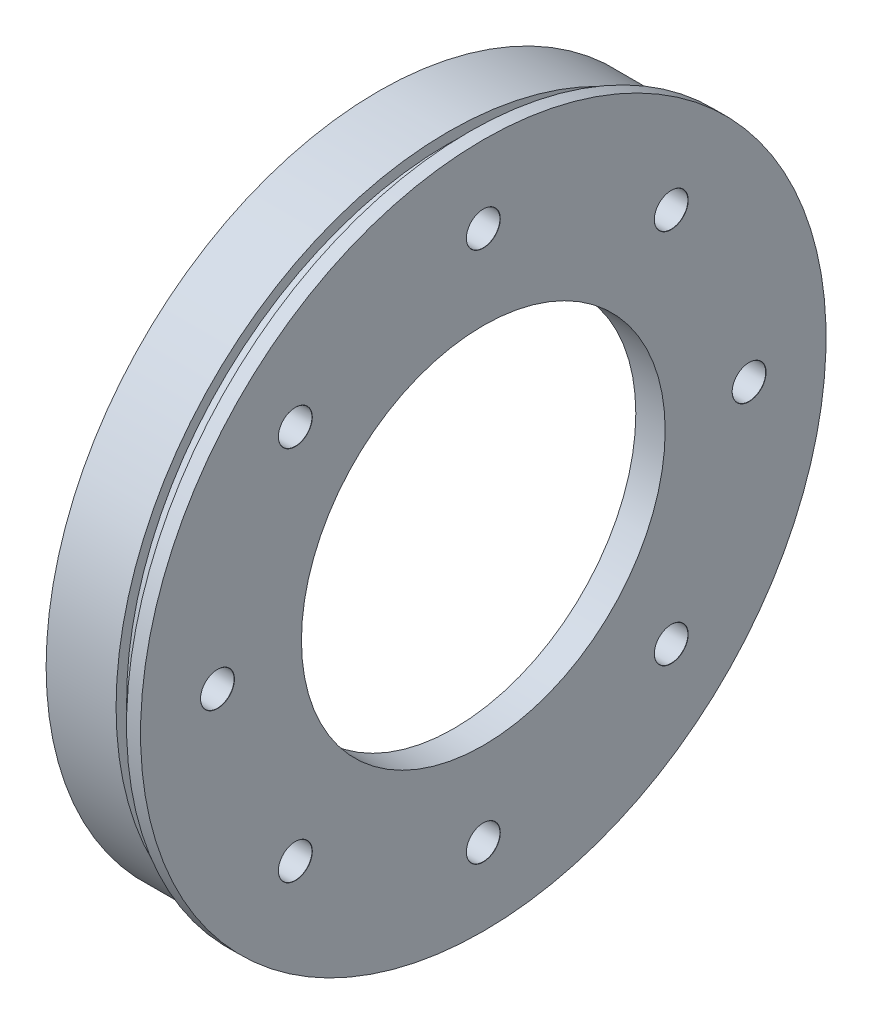
ISO-10303-21;
HEADER;
FILE_DESCRIPTION(('STEP AP214'),'2;1');
FILE_NAME('part.step','',(''),(''),'','','');
FILE_SCHEMA(('AUTOMOTIVE_DESIGN { 1 0 10303 214 1 1 1 1 }'));
ENDSEC;
DATA;
#1=APPLICATION_CONTEXT('core data for automotive mechanical design processes');
#2=APPLICATION_PROTOCOL_DEFINITION('international standard','automotive_design',2000,#1);
#3=PRODUCT_CONTEXT('',#1,'mechanical');
#4=PRODUCT('Part','Part','',(#3));
#5=PRODUCT_RELATED_PRODUCT_CATEGORY('part','',(#4));
#6=PRODUCT_DEFINITION_FORMATION('','',#4);
#7=PRODUCT_DEFINITION_CONTEXT('part definition',#1,'design');
#8=PRODUCT_DEFINITION('design','',#6,#7);
#9=PRODUCT_DEFINITION_SHAPE('','',#8);
#10=(LENGTH_UNIT() NAMED_UNIT(*) SI_UNIT(.MILLI.,.METRE.));
#11=(NAMED_UNIT(*) PLANE_ANGLE_UNIT() SI_UNIT($,.RADIAN.));
#12=(NAMED_UNIT(*) SI_UNIT($,.STERADIAN.) SOLID_ANGLE_UNIT());
#13=UNCERTAINTY_MEASURE_WITH_UNIT(LENGTH_MEASURE(1.E-05),#10,'distance_accuracy_value','');
#14=(GEOMETRIC_REPRESENTATION_CONTEXT(3) GLOBAL_UNCERTAINTY_ASSIGNED_CONTEXT((#13)) GLOBAL_UNIT_ASSIGNED_CONTEXT((#10,
#11,#12)) REPRESENTATION_CONTEXT('',''));
#15=CARTESIAN_POINT('',(0.,0.,0.));
#16=DIRECTION('',(0.,0.,1.));
#17=DIRECTION('',(1.,0.,0.));
#18=AXIS2_PLACEMENT_3D('',#15,#16,#17);
#19=CARTESIAN_POINT('',(0.,0.,0.));
#20=DIRECTION('',(1.,0.,0.));
#21=DIRECTION('',(0.,1.,0.));
#22=AXIS2_PLACEMENT_3D('',#19,#20,#21);
#23=CYLINDRICAL_SURFACE('',#22,26.);
#24=CARTESIAN_POINT('',(0.,0.,0.));
#25=DIRECTION('',(1.,0.,0.));
#26=DIRECTION('',(0.,1.,0.));
#27=AXIS2_PLACEMENT_3D('',#24,#25,#26);
#28=CIRCLE('',#27,26.);
#29=CARTESIAN_POINT('',(0.,26.,0.));
#30=VERTEX_POINT('',#29);
#31=EDGE_CURVE('E163',#30,#30,#28,.T.);
#32=ORIENTED_EDGE('',*,*,#31,.T.);
#33=EDGE_LOOP('',(#32));
#34=FACE_BOUND('',#33,.T.);
#35=CARTESIAN_POINT('',(-4.19999999999999,0.,0.));
#36=DIRECTION('',(-1.,0.,0.));
#37=DIRECTION('',(0.,-1.,0.));
#38=AXIS2_PLACEMENT_3D('',#35,#36,#37);
#39=CIRCLE('',#38,26.);
#40=CARTESIAN_POINT('',(-4.19999999999999,-26.,0.));
#41=VERTEX_POINT('',#40);
#42=EDGE_CURVE('E40',#41,#41,#39,.T.);
#43=ORIENTED_EDGE('',*,*,#42,.T.);
#44=EDGE_LOOP('',(#43));
#45=FACE_BOUND('',#44,.T.);
#46=ADVANCED_FACE('F36',(#34,#45),#23,.F.);
#47=CARTESIAN_POINT('',(-15.,42.8,0.));
#48=DIRECTION('',(-1.,0.,0.));
#49=DIRECTION('',(0.,-1.,0.));
#50=AXIS2_PLACEMENT_3D('',#47,#48,#49);
#51=PLANE('',#50);
#52=CARTESIAN_POINT('',(-15.,0.,0.));
#53=DIRECTION('',(1.,0.,0.));
#54=DIRECTION('',(0.,1.,0.));
#55=AXIS2_PLACEMENT_3D('',#52,#53,#54);
#56=CIRCLE('',#55,42.8);
#57=CARTESIAN_POINT('',(-15.,42.8,0.));
#58=VERTEX_POINT('',#57);
#59=EDGE_CURVE('E59',#58,#58,#56,.T.);
#60=ORIENTED_EDGE('',*,*,#59,.T.);
#61=EDGE_LOOP('',(#60));
#62=FACE_BOUND('',#61,.T.);
#63=CARTESIAN_POINT('',(-15.,0.,0.));
#64=DIRECTION('',(1.,0.,0.));
#65=DIRECTION('',(0.,1.,0.));
#66=AXIS2_PLACEMENT_3D('',#63,#64,#65);
#67=CIRCLE('',#66,47.5);
#68=CARTESIAN_POINT('',(-15.,47.5,0.));
#69=VERTEX_POINT('',#68);
#70=EDGE_CURVE('E10',#69,#69,#67,.T.);
#71=ORIENTED_EDGE('',*,*,#70,.F.);
#72=EDGE_LOOP('',(#71));
#73=FACE_BOUND('',#72,.T.);
#74=ADVANCED_FACE('F38',(#62,#73),#51,.T.);
#75=CARTESIAN_POINT('',(0.,0.,0.));
#76=DIRECTION('',(1.,0.,0.));
#77=DIRECTION('',(0.,1.,0.));
#78=AXIS2_PLACEMENT_3D('',#75,#76,#77);
#79=CYLINDRICAL_SURFACE('',#78,47.5);
#80=ORIENTED_EDGE('',*,*,#70,.T.);
#81=EDGE_LOOP('',(#80));
#82=FACE_BOUND('',#81,.T.);
#83=CARTESIAN_POINT('',(-4.99999999999999,0.,0.));
#84=DIRECTION('',(1.,0.,0.));
#85=DIRECTION('',(0.,1.,0.));
#86=AXIS2_PLACEMENT_3D('',#83,#84,#85);
#87=CIRCLE('',#86,47.5);
#88=CARTESIAN_POINT('',(-5.,47.5,0.));
#89=VERTEX_POINT('',#88);
#90=EDGE_CURVE('E45',#89,#89,#87,.T.);
#91=ORIENTED_EDGE('',*,*,#90,.F.);
#92=EDGE_LOOP('',(#91));
#93=FACE_BOUND('',#92,.T.);
#94=ADVANCED_FACE('F187',(#82,#93),#79,.T.);
#95=CARTESIAN_POINT('',(-5.,47.5,0.));
#96=DIRECTION('',(1.,0.,0.));
#97=DIRECTION('',(0.,1.,0.));
#98=AXIS2_PLACEMENT_3D('',#95,#96,#97);
#99=PLANE('',#98);
#100=ORIENTED_EDGE('',*,*,#90,.T.);
#101=EDGE_LOOP('',(#100));
#102=FACE_BOUND('',#101,.T.);
#103=CARTESIAN_POINT('',(-4.99999999999999,0.,0.));
#104=DIRECTION('',(1.,0.,0.));
#105=DIRECTION('',(0.,1.,0.));
#106=AXIS2_PLACEMENT_3D('',#103,#104,#105);
#107=CIRCLE('',#106,46.);
#108=CARTESIAN_POINT('',(-5.,46.,0.));
#109=VERTEX_POINT('',#108);
#110=EDGE_CURVE('E51',#109,#109,#107,.T.);
#111=ORIENTED_EDGE('',*,*,#110,.F.);
#112=EDGE_LOOP('',(#111));
#113=FACE_BOUND('',#112,.T.);
#114=ADVANCED_FACE('F185',(#102,#113),#99,.T.);
#115=CARTESIAN_POINT('',(0.,0.,0.));
#116=DIRECTION('',(1.,0.,0.));
#117=DIRECTION('',(0.,1.,0.));
#118=AXIS2_PLACEMENT_3D('',#115,#116,#117);
#119=CYLINDRICAL_SURFACE('',#118,46.);
#120=ORIENTED_EDGE('',*,*,#110,.T.);
#121=EDGE_LOOP('',(#120));
#122=FACE_BOUND('',#121,.T.);
#123=CARTESIAN_POINT('',(-1.99999999999999,0.,0.));
#124=DIRECTION('',(1.,0.,0.));
#125=DIRECTION('',(0.,1.,0.));
#126=AXIS2_PLACEMENT_3D('',#123,#124,#125);
#127=CIRCLE('',#126,46.);
#128=CARTESIAN_POINT('',(-2.,46.,0.));
#129=VERTEX_POINT('',#128);
#130=EDGE_CURVE('E175',#129,#129,#127,.T.);
#131=ORIENTED_EDGE('',*,*,#130,.F.);
#132=EDGE_LOOP('',(#131));
#133=FACE_BOUND('',#132,.T.);
#134=ADVANCED_FACE('F182',(#122,#133),#119,.T.);
#135=CARTESIAN_POINT('',(-2.,46.,0.));
#136=DIRECTION('',(-1.,0.,0.));
#137=DIRECTION('',(0.,-1.,0.));
#138=AXIS2_PLACEMENT_3D('',#135,#136,#137);
#139=PLANE('',#138);
#140=ORIENTED_EDGE('',*,*,#130,.T.);
#141=EDGE_LOOP('',(#140));
#142=FACE_BOUND('',#141,.T.);
#143=CARTESIAN_POINT('',(-1.99999999999999,0.,0.));
#144=DIRECTION('',(1.,0.,0.));
#145=DIRECTION('',(0.,1.,0.));
#146=AXIS2_PLACEMENT_3D('',#143,#144,#145);
#147=CIRCLE('',#146,49.);
#148=CARTESIAN_POINT('',(-2.,49.,0.));
#149=VERTEX_POINT('',#148);
#150=EDGE_CURVE('E171',#149,#149,#147,.T.);
#151=ORIENTED_EDGE('',*,*,#150,.F.);
#152=EDGE_LOOP('',(#151));
#153=FACE_BOUND('',#152,.T.);
#154=ADVANCED_FACE('F194',(#142,#153),#139,.T.);
#155=CARTESIAN_POINT('',(0.,0.,0.));
#156=DIRECTION('',(1.,0.,0.));
#157=DIRECTION('',(0.,1.,0.));
#158=AXIS2_PLACEMENT_3D('',#155,#156,#157);
#159=CYLINDRICAL_SURFACE('',#158,49.);
#160=ORIENTED_EDGE('',*,*,#150,.T.);
#161=EDGE_LOOP('',(#160));
#162=FACE_BOUND('',#161,.T.);
#163=CARTESIAN_POINT('',(0.,0.,0.));
#164=DIRECTION('',(1.,0.,0.));
#165=DIRECTION('',(0.,1.,0.));
#166=AXIS2_PLACEMENT_3D('',#163,#164,#165);
#167=CIRCLE('',#166,49.);
#168=CARTESIAN_POINT('',(0.,49.,0.));
#169=VERTEX_POINT('',#168);
#170=EDGE_CURVE('E167',#169,#169,#167,.T.);
#171=ORIENTED_EDGE('',*,*,#170,.F.);
#172=EDGE_LOOP('',(#171));
#173=FACE_BOUND('',#172,.T.);
#174=ADVANCED_FACE('F213',(#162,#173),#159,.T.);
#175=CARTESIAN_POINT('',(0.,49.,0.));
#176=DIRECTION('',(1.,0.,0.));
#177=DIRECTION('',(0.,1.,0.));
#178=AXIS2_PLACEMENT_3D('',#175,#176,#177);
#179=PLANE('',#178);
#180=CARTESIAN_POINT('',(0.,26.8700576850885,26.8700576850891));
#181=DIRECTION('',(1.,0.,0.));
#182=DIRECTION('',(0.,0.,-1.));
#183=AXIS2_PLACEMENT_3D('',#180,#181,#182);
#184=CIRCLE('',#183,2.425);
#185=CARTESIAN_POINT('',(0.,26.8700576850885,24.4450576850891));
#186=VERTEX_POINT('',#185);
#187=EDGE_CURVE('E108',#186,#186,#184,.T.);
#188=ORIENTED_EDGE('',*,*,#187,.F.);
#189=EDGE_LOOP('',(#188));
#190=FACE_BOUND('',#189,.T.);
#191=CARTESIAN_POINT('',(0.,38.,3.98028872628117E-13));
#192=DIRECTION('',(1.,0.,0.));
#193=DIRECTION('',(0.,0.,-1.));
#194=AXIS2_PLACEMENT_3D('',#191,#192,#193);
#195=CIRCLE('',#194,2.425);
#196=CARTESIAN_POINT('',(0.,38.,-2.42499999999961));
#197=VERTEX_POINT('',#196);
#198=EDGE_CURVE('E99',#197,#197,#195,.T.);
#199=ORIENTED_EDGE('',*,*,#198,.F.);
#200=EDGE_LOOP('',(#199));
#201=FACE_BOUND('',#200,.T.);
#202=CARTESIAN_POINT('',(0.,26.870057685089,-26.8700576850886));
#203=DIRECTION('',(1.,0.,0.));
#204=DIRECTION('',(0.,0.,-1.));
#205=AXIS2_PLACEMENT_3D('',#202,#203,#204);
#206=CIRCLE('',#205,2.425);
#207=CARTESIAN_POINT('',(0.,26.870057685089,-29.2950576850886));
#208=VERTEX_POINT('',#207);
#209=EDGE_CURVE('E94',#208,#208,#206,.T.);
#210=ORIENTED_EDGE('',*,*,#209,.F.);
#211=EDGE_LOOP('',(#210));
#212=FACE_BOUND('',#211,.T.);
#213=CARTESIAN_POINT('',(0.,0.,-38.));
#214=DIRECTION('',(1.,0.,0.));
#215=DIRECTION('',(0.,0.,-1.));
#216=AXIS2_PLACEMENT_3D('',#213,#214,#215);
#217=CIRCLE('',#216,2.425);
#218=CARTESIAN_POINT('',(0.,0.,-40.425));
#219=VERTEX_POINT('',#218);
#220=EDGE_CURVE('E89',#219,#219,#217,.T.);
#221=ORIENTED_EDGE('',*,*,#220,.F.);
#222=EDGE_LOOP('',(#221));
#223=FACE_BOUND('',#222,.T.);
#224=CARTESIAN_POINT('',(0.,-26.8700576850887,-26.8700576850889));
#225=DIRECTION('',(1.,0.,0.));
#226=DIRECTION('',(0.,0.,-1.));
#227=AXIS2_PLACEMENT_3D('',#224,#225,#226);
#228=CIRCLE('',#227,2.425);
#229=CARTESIAN_POINT('',(0.,-26.8700576850887,-29.2950576850889));
#230=VERTEX_POINT('',#229);
#231=EDGE_CURVE('E83',#230,#230,#228,.T.);
#232=ORIENTED_EDGE('',*,*,#231,.F.);
#233=EDGE_LOOP('',(#232));
#234=FACE_BOUND('',#233,.T.);
#235=CARTESIAN_POINT('',(0.,-38.,-1.32676290876039E-13));
#236=DIRECTION('',(1.,0.,0.));
#237=DIRECTION('',(0.,0.,-1.));
#238=AXIS2_PLACEMENT_3D('',#235,#236,#237);
#239=CIRCLE('',#238,2.425);
#240=CARTESIAN_POINT('',(0.,-38.,-2.42500000000014));
#241=VERTEX_POINT('',#240);
#242=EDGE_CURVE('E77',#241,#241,#239,.T.);
#243=ORIENTED_EDGE('',*,*,#242,.F.);
#244=EDGE_LOOP('',(#243));
#245=FACE_BOUND('',#244,.T.);
#246=CARTESIAN_POINT('',(0.,-26.8700576850889,26.8700576850888));
#247=DIRECTION('',(1.,0.,0.));
#248=DIRECTION('',(0.,0.,-1.));
#249=AXIS2_PLACEMENT_3D('',#246,#247,#248);
#250=CIRCLE('',#249,2.425);
#251=CARTESIAN_POINT('',(0.,-26.8700576850889,24.4450576850888));
#252=VERTEX_POINT('',#251);
#253=EDGE_CURVE('E71',#252,#252,#250,.T.);
#254=ORIENTED_EDGE('',*,*,#253,.F.);
#255=EDGE_LOOP('',(#254));
#256=FACE_BOUND('',#255,.T.);
#257=CARTESIAN_POINT('',(0.,0.,38.));
#258=DIRECTION('',(1.,0.,0.));
#259=DIRECTION('',(0.,0.,-1.));
#260=AXIS2_PLACEMENT_3D('',#257,#258,#259);
#261=CIRCLE('',#260,2.425);
#262=CARTESIAN_POINT('',(0.,0.,35.575));
#263=VERTEX_POINT('',#262);
#264=EDGE_CURVE('E65',#263,#263,#261,.T.);
#265=ORIENTED_EDGE('',*,*,#264,.F.);
#266=EDGE_LOOP('',(#265));
#267=FACE_BOUND('',#266,.T.);
#268=ORIENTED_EDGE('',*,*,#170,.T.);
#269=EDGE_LOOP('',(#268));
#270=FACE_BOUND('',#269,.T.);
#271=ORIENTED_EDGE('',*,*,#31,.F.);
#272=EDGE_LOOP('',(#271));
#273=FACE_BOUND('',#272,.T.);
#274=ADVANCED_FACE('F210',(#190,#201,#212,#223,#234,#245,#256,#267,#270,#273),#179,.T.);
#275=CARTESIAN_POINT('',(-5.,26.,0.));
#276=DIRECTION('',(-1.,0.,0.));
#277=DIRECTION('',(0.,-1.,0.));
#278=AXIS2_PLACEMENT_3D('',#275,#276,#277);
#279=PLANE('',#278);
#280=CARTESIAN_POINT('',(-4.99999999999999,0.,0.));
#281=DIRECTION('',(-1.,0.,0.));
#282=DIRECTION('',(0.,-1.,0.));
#283=AXIS2_PLACEMENT_3D('',#280,#281,#282);
#284=CIRCLE('',#283,28.);
#285=CARTESIAN_POINT('',(-4.99999999999999,-28.,0.));
#286=VERTEX_POINT('',#285);
#287=EDGE_CURVE('E415',#286,#286,#284,.T.);
#288=ORIENTED_EDGE('',*,*,#287,.F.);
#289=EDGE_LOOP('',(#288));
#290=FACE_BOUND('',#289,.T.);
#291=CARTESIAN_POINT('',(-5.,26.8700576850885,26.8700576850891));
#292=DIRECTION('',(-1.,0.,0.));
#293=DIRECTION('',(0.,-1.,0.));
#294=AXIS2_PLACEMENT_3D('',#291,#292,#293);
#295=CIRCLE('',#294,2.4);
#296=CARTESIAN_POINT('',(-5.,24.4700576850885,26.8700576850891));
#297=VERTEX_POINT('',#296);
#298=EDGE_CURVE('E96',#297,#297,#295,.T.);
#299=ORIENTED_EDGE('',*,*,#298,.F.);
#300=EDGE_LOOP('',(#299));
#301=FACE_BOUND('',#300,.T.);
#302=CARTESIAN_POINT('',(-5.,38.,3.98028872628117E-13));
#303=DIRECTION('',(-1.,0.,0.));
#304=DIRECTION('',(0.,-1.,0.));
#305=AXIS2_PLACEMENT_3D('',#302,#303,#304);
#306=CIRCLE('',#305,2.4);
#307=CARTESIAN_POINT('',(-5.,35.6,3.98028872628117E-13));
#308=VERTEX_POINT('',#307);
#309=EDGE_CURVE('E91',#308,#308,#306,.T.);
#310=ORIENTED_EDGE('',*,*,#309,.F.);
#311=EDGE_LOOP('',(#310));
#312=FACE_BOUND('',#311,.T.);
#313=CARTESIAN_POINT('',(-5.,26.870057685089,-26.8700576850886));
#314=DIRECTION('',(-1.,0.,0.));
#315=DIRECTION('',(0.,-1.,0.));
#316=AXIS2_PLACEMENT_3D('',#313,#314,#315);
#317=CIRCLE('',#316,2.4);
#318=CARTESIAN_POINT('',(-5.,24.470057685089,-26.8700576850886));
#319=VERTEX_POINT('',#318);
#320=EDGE_CURVE('E85',#319,#319,#317,.T.);
#321=ORIENTED_EDGE('',*,*,#320,.F.);
#322=EDGE_LOOP('',(#321));
#323=FACE_BOUND('',#322,.T.);
#324=CARTESIAN_POINT('',(-4.99999999999999,0.,-38.));
#325=DIRECTION('',(-1.,0.,0.));
#326=DIRECTION('',(0.,-1.,0.));
#327=AXIS2_PLACEMENT_3D('',#324,#325,#326);
#328=CIRCLE('',#327,2.4);
#329=CARTESIAN_POINT('',(-4.99999999999999,-2.4,-38.));
#330=VERTEX_POINT('',#329);
#331=EDGE_CURVE('E79',#330,#330,#328,.T.);
#332=ORIENTED_EDGE('',*,*,#331,.F.);
#333=EDGE_LOOP('',(#332));
#334=FACE_BOUND('',#333,.T.);
#335=CARTESIAN_POINT('',(-4.99999999999999,-26.8700576850887,-26.8700576850889));
#336=DIRECTION('',(-1.,0.,0.));
#337=DIRECTION('',(0.,-1.,0.));
#338=AXIS2_PLACEMENT_3D('',#335,#336,#337);
#339=CIRCLE('',#338,2.4);
#340=CARTESIAN_POINT('',(-4.99999999999999,-29.2700576850887,-26.8700576850889));
#341=VERTEX_POINT('',#340);
#342=EDGE_CURVE('E73',#341,#341,#339,.T.);
#343=ORIENTED_EDGE('',*,*,#342,.F.);
#344=EDGE_LOOP('',(#343));
#345=FACE_BOUND('',#344,.T.);
#346=CARTESIAN_POINT('',(-4.99999999999999,-38.,-1.32676290876039E-13));
#347=DIRECTION('',(-1.,0.,0.));
#348=DIRECTION('',(0.,-1.,0.));
#349=AXIS2_PLACEMENT_3D('',#346,#347,#348);
#350=CIRCLE('',#349,2.4);
#351=CARTESIAN_POINT('',(-4.99999999999999,-40.4,-1.32676290876039E-13));
#352=VERTEX_POINT('',#351);
#353=EDGE_CURVE('E67',#352,#352,#350,.T.);
#354=ORIENTED_EDGE('',*,*,#353,.F.);
#355=EDGE_LOOP('',(#354));
#356=FACE_BOUND('',#355,.T.);
#357=CARTESIAN_POINT('',(-4.99999999999999,-26.8700576850889,26.8700576850888));
#358=DIRECTION('',(-1.,0.,0.));
#359=DIRECTION('',(0.,-1.,0.));
#360=AXIS2_PLACEMENT_3D('',#357,#358,#359);
#361=CIRCLE('',#360,2.4);
#362=CARTESIAN_POINT('',(-4.99999999999999,-29.2700576850888,26.8700576850888));
#363=VERTEX_POINT('',#362);
#364=EDGE_CURVE('E61',#363,#363,#361,.T.);
#365=ORIENTED_EDGE('',*,*,#364,.F.);
#366=EDGE_LOOP('',(#365));
#367=FACE_BOUND('',#366,.T.);
#368=CARTESIAN_POINT('',(-4.99999999999999,0.,38.));
#369=DIRECTION('',(-1.,0.,0.));
#370=DIRECTION('',(0.,-1.,0.));
#371=AXIS2_PLACEMENT_3D('',#368,#369,#370);
#372=CIRCLE('',#371,2.4);
#373=CARTESIAN_POINT('',(-4.99999999999999,-2.4,38.));
#374=VERTEX_POINT('',#373);
#375=EDGE_CURVE('E55',#374,#374,#372,.T.);
#376=ORIENTED_EDGE('',*,*,#375,.F.);
#377=EDGE_LOOP('',(#376));
#378=FACE_BOUND('',#377,.T.);
#379=CARTESIAN_POINT('',(-4.99999999999999,0.,0.));
#380=DIRECTION('',(1.,0.,0.));
#381=DIRECTION('',(0.,1.,0.));
#382=AXIS2_PLACEMENT_3D('',#379,#380,#381);
#383=CIRCLE('',#382,42.8);
#384=CARTESIAN_POINT('',(-5.,42.8,0.));
#385=VERTEX_POINT('',#384);
#386=EDGE_CURVE('E159',#385,#385,#383,.T.);
#387=ORIENTED_EDGE('',*,*,#386,.F.);
#388=EDGE_LOOP('',(#387));
#389=FACE_BOUND('',#388,.T.);
#390=ADVANCED_FACE('F208',(#290,#301,#312,#323,#334,#345,#356,#367,#378,#389),#279,.T.);
#391=CARTESIAN_POINT('',(0.,0.,0.));
#392=DIRECTION('',(1.,0.,0.));
#393=DIRECTION('',(0.,1.,0.));
#394=AXIS2_PLACEMENT_3D('',#391,#392,#393);
#395=CYLINDRICAL_SURFACE('',#394,42.8);
#396=ORIENTED_EDGE('',*,*,#386,.T.);
#397=EDGE_LOOP('',(#396));
#398=FACE_BOUND('',#397,.T.);
#399=ORIENTED_EDGE('',*,*,#59,.F.);
#400=EDGE_LOOP('',(#399));
#401=FACE_BOUND('',#400,.T.);
#402=ADVANCED_FACE('F251',(#398,#401),#395,.F.);
#403=CARTESIAN_POINT('',(0.,0.,38.));
#404=DIRECTION('',(1.,0.,0.));
#405=DIRECTION('',(0.,0.,-1.));
#406=AXIS2_PLACEMENT_3D('',#403,#404,#405);
#407=CYLINDRICAL_SURFACE('',#406,2.4);
#408=ORIENTED_EDGE('',*,*,#375,.T.);
#409=EDGE_LOOP('',(#408));
#410=FACE_BOUND('',#409,.T.);
#411=CARTESIAN_POINT('',(-0.0250000000000007,0.,38.));
#412=DIRECTION('',(1.,0.,0.));
#413=DIRECTION('',(0.,0.,-1.));
#414=AXIS2_PLACEMENT_3D('',#411,#412,#413);
#415=CIRCLE('',#414,2.4);
#416=CARTESIAN_POINT('',(-0.0250000000000007,0.,35.6));
#417=VERTEX_POINT('',#416);
#418=EDGE_CURVE('E60',#417,#417,#415,.T.);
#419=ORIENTED_EDGE('',*,*,#418,.T.);
#420=EDGE_LOOP('',(#419));
#421=FACE_BOUND('',#420,.T.);
#422=ADVANCED_FACE('F260',(#410,#421),#407,.F.);
#423=CARTESIAN_POINT('',(0.,0.,38.));
#424=DIRECTION('',(1.,0.,0.));
#425=DIRECTION('',(0.,0.,-1.));
#426=AXIS2_PLACEMENT_3D('',#423,#424,#425);
#427=CONICAL_SURFACE('',#426,2.425,0.785398163397483);
#428=ORIENTED_EDGE('',*,*,#418,.F.);
#429=EDGE_LOOP('',(#428));
#430=FACE_BOUND('',#429,.T.);
#431=ORIENTED_EDGE('',*,*,#264,.T.);
#432=EDGE_LOOP('',(#431));
#433=FACE_BOUND('',#432,.T.);
#434=ADVANCED_FACE('F272',(#430,#433),#427,.F.);
#435=CARTESIAN_POINT('',(0.,-26.8700576850889,26.8700576850888));
#436=DIRECTION('',(1.,0.,0.));
#437=DIRECTION('',(0.,0.,-1.));
#438=AXIS2_PLACEMENT_3D('',#435,#436,#437);
#439=CYLINDRICAL_SURFACE('',#438,2.4);
#440=ORIENTED_EDGE('',*,*,#364,.T.);
#441=EDGE_LOOP('',(#440));
#442=FACE_BOUND('',#441,.T.);
#443=CARTESIAN_POINT('',(-0.0249999999999974,-26.8700576850889,26.8700576850888));
#444=DIRECTION('',(1.,0.,0.));
#445=DIRECTION('',(0.,0.,-1.));
#446=AXIS2_PLACEMENT_3D('',#443,#444,#445);
#447=CIRCLE('',#446,2.4);
#448=CARTESIAN_POINT('',(-0.0249999999999974,-26.8700576850889,24.4700576850888));
#449=VERTEX_POINT('',#448);
#450=EDGE_CURVE('E66',#449,#449,#447,.T.);
#451=ORIENTED_EDGE('',*,*,#450,.T.);
#452=EDGE_LOOP('',(#451));
#453=FACE_BOUND('',#452,.T.);
#454=ADVANCED_FACE('F279',(#442,#453),#439,.F.);
#455=CARTESIAN_POINT('',(0.,-26.8700576850889,26.8700576850888));
#456=DIRECTION('',(1.,0.,0.));
#457=DIRECTION('',(0.,0.,-1.));
#458=AXIS2_PLACEMENT_3D('',#455,#456,#457);
#459=CONICAL_SURFACE('',#458,2.425,0.785398163397518);
#460=ORIENTED_EDGE('',*,*,#450,.F.);
#461=EDGE_LOOP('',(#460));
#462=FACE_BOUND('',#461,.T.);
#463=ORIENTED_EDGE('',*,*,#253,.T.);
#464=EDGE_LOOP('',(#463));
#465=FACE_BOUND('',#464,.T.);
#466=ADVANCED_FACE('F286',(#462,#465),#459,.F.);
#467=CARTESIAN_POINT('',(0.,-38.,-1.32676290876039E-13));
#468=DIRECTION('',(1.,0.,0.));
#469=DIRECTION('',(0.,0.,-1.));
#470=AXIS2_PLACEMENT_3D('',#467,#468,#469);
#471=CYLINDRICAL_SURFACE('',#470,2.4);
#472=ORIENTED_EDGE('',*,*,#353,.T.);
#473=EDGE_LOOP('',(#472));
#474=FACE_BOUND('',#473,.T.);
#475=CARTESIAN_POINT('',(-0.0249999999999961,-38.,-1.32676290876039E-13));
#476=DIRECTION('',(1.,0.,0.));
#477=DIRECTION('',(0.,0.,-1.));
#478=AXIS2_PLACEMENT_3D('',#475,#476,#477);
#479=CIRCLE('',#478,2.4);
#480=CARTESIAN_POINT('',(-0.0249999999999961,-38.,-2.40000000000013));
#481=VERTEX_POINT('',#480);
#482=EDGE_CURVE('E72',#481,#481,#479,.T.);
#483=ORIENTED_EDGE('',*,*,#482,.T.);
#484=EDGE_LOOP('',(#483));
#485=FACE_BOUND('',#484,.T.);
#486=ADVANCED_FACE('F294',(#474,#485),#471,.F.);
#487=CARTESIAN_POINT('',(0.,-38.,-1.32676290876039E-13));
#488=DIRECTION('',(1.,0.,0.));
#489=DIRECTION('',(0.,0.,-1.));
#490=AXIS2_PLACEMENT_3D('',#487,#488,#489);
#491=CONICAL_SURFACE('',#490,2.425,0.785398163397518);
#492=ORIENTED_EDGE('',*,*,#482,.F.);
#493=EDGE_LOOP('',(#492));
#494=FACE_BOUND('',#493,.T.);
#495=ORIENTED_EDGE('',*,*,#242,.T.);
#496=EDGE_LOOP('',(#495));
#497=FACE_BOUND('',#496,.T.);
#498=ADVANCED_FACE('F302',(#494,#497),#491,.F.);
#499=CARTESIAN_POINT('',(0.,-26.8700576850887,-26.8700576850889));
#500=DIRECTION('',(1.,0.,0.));
#501=DIRECTION('',(0.,0.,-1.));
#502=AXIS2_PLACEMENT_3D('',#499,#500,#501);
#503=CYLINDRICAL_SURFACE('',#502,2.4);
#504=ORIENTED_EDGE('',*,*,#342,.T.);
#505=EDGE_LOOP('',(#504));
#506=FACE_BOUND('',#505,.T.);
#507=CARTESIAN_POINT('',(-0.0249999999999974,-26.8700576850887,-26.8700576850889));
#508=DIRECTION('',(1.,0.,0.));
#509=DIRECTION('',(0.,0.,-1.));
#510=AXIS2_PLACEMENT_3D('',#507,#508,#509);
#511=CIRCLE('',#510,2.4);
#512=CARTESIAN_POINT('',(-0.0249999999999974,-26.8700576850887,-29.2700576850889));
#513=VERTEX_POINT('',#512);
#514=EDGE_CURVE('E78',#513,#513,#511,.T.);
#515=ORIENTED_EDGE('',*,*,#514,.T.);
#516=EDGE_LOOP('',(#515));
#517=FACE_BOUND('',#516,.T.);
#518=ADVANCED_FACE('F310',(#506,#517),#503,.F.);
#519=CARTESIAN_POINT('',(0.,-26.8700576850887,-26.8700576850889));
#520=DIRECTION('',(1.,0.,0.));
#521=DIRECTION('',(0.,0.,-1.));
#522=AXIS2_PLACEMENT_3D('',#519,#520,#521);
#523=CONICAL_SURFACE('',#522,2.425,0.785398163397448);
#524=ORIENTED_EDGE('',*,*,#514,.F.);
#525=EDGE_LOOP('',(#524));
#526=FACE_BOUND('',#525,.T.);
#527=ORIENTED_EDGE('',*,*,#231,.T.);
#528=EDGE_LOOP('',(#527));
#529=FACE_BOUND('',#528,.T.);
#530=ADVANCED_FACE('F318',(#526,#529),#523,.F.);
#531=CARTESIAN_POINT('',(0.,0.,-38.));
#532=DIRECTION('',(1.,0.,0.));
#533=DIRECTION('',(0.,0.,-1.));
#534=AXIS2_PLACEMENT_3D('',#531,#532,#533);
#535=CYLINDRICAL_SURFACE('',#534,2.4);
#536=ORIENTED_EDGE('',*,*,#331,.T.);
#537=EDGE_LOOP('',(#536));
#538=FACE_BOUND('',#537,.T.);
#539=CARTESIAN_POINT('',(-0.0250000000000007,0.,-38.));
#540=DIRECTION('',(1.,0.,0.));
#541=DIRECTION('',(0.,0.,-1.));
#542=AXIS2_PLACEMENT_3D('',#539,#540,#541);
#543=CIRCLE('',#542,2.4);
#544=CARTESIAN_POINT('',(-0.0250000000000007,0.,-40.4));
#545=VERTEX_POINT('',#544);
#546=EDGE_CURVE('E84',#545,#545,#543,.T.);
#547=ORIENTED_EDGE('',*,*,#546,.T.);
#548=EDGE_LOOP('',(#547));
#549=FACE_BOUND('',#548,.T.);
#550=ADVANCED_FACE('F326',(#538,#549),#535,.F.);
#551=CARTESIAN_POINT('',(0.,0.,-38.));
#552=DIRECTION('',(1.,0.,0.));
#553=DIRECTION('',(0.,0.,-1.));
#554=AXIS2_PLACEMENT_3D('',#551,#552,#553);
#555=CONICAL_SURFACE('',#554,2.425,0.785398163397483);
#556=ORIENTED_EDGE('',*,*,#546,.F.);
#557=EDGE_LOOP('',(#556));
#558=FACE_BOUND('',#557,.T.);
#559=ORIENTED_EDGE('',*,*,#220,.T.);
#560=EDGE_LOOP('',(#559));
#561=FACE_BOUND('',#560,.T.);
#562=ADVANCED_FACE('F334',(#558,#561),#555,.F.);
#563=CARTESIAN_POINT('',(0.,26.870057685089,-26.8700576850886));
#564=DIRECTION('',(1.,0.,0.));
#565=DIRECTION('',(0.,0.,-1.));
#566=AXIS2_PLACEMENT_3D('',#563,#564,#565);
#567=CYLINDRICAL_SURFACE('',#566,2.4);
#568=ORIENTED_EDGE('',*,*,#320,.T.);
#569=EDGE_LOOP('',(#568));
#570=FACE_BOUND('',#569,.T.);
#571=CARTESIAN_POINT('',(-0.025000000000004,26.870057685089,-26.8700576850886));
#572=DIRECTION('',(1.,0.,0.));
#573=DIRECTION('',(0.,0.,-1.));
#574=AXIS2_PLACEMENT_3D('',#571,#572,#573);
#575=CIRCLE('',#574,2.4);
#576=CARTESIAN_POINT('',(-0.025000000000004,26.870057685089,-29.2700576850886));
#577=VERTEX_POINT('',#576);
#578=EDGE_CURVE('E90',#577,#577,#575,.T.);
#579=ORIENTED_EDGE('',*,*,#578,.T.);
#580=EDGE_LOOP('',(#579));
#581=FACE_BOUND('',#580,.T.);
#582=ADVANCED_FACE('F342',(#570,#581),#567,.F.);
#583=CARTESIAN_POINT('',(0.,26.870057685089,-26.8700576850886));
#584=DIRECTION('',(1.,0.,0.));
#585=DIRECTION('',(0.,0.,-1.));
#586=AXIS2_PLACEMENT_3D('',#583,#584,#585);
#587=CONICAL_SURFACE('',#586,2.425,0.785398163397518);
#588=ORIENTED_EDGE('',*,*,#578,.F.);
#589=EDGE_LOOP('',(#588));
#590=FACE_BOUND('',#589,.T.);
#591=ORIENTED_EDGE('',*,*,#209,.T.);
#592=EDGE_LOOP('',(#591));
#593=FACE_BOUND('',#592,.T.);
#594=ADVANCED_FACE('F350',(#590,#593),#587,.F.);
#595=CARTESIAN_POINT('',(0.,38.,3.98028872628117E-13));
#596=DIRECTION('',(1.,0.,0.));
#597=DIRECTION('',(0.,0.,-1.));
#598=AXIS2_PLACEMENT_3D('',#595,#596,#597);
#599=CYLINDRICAL_SURFACE('',#598,2.4);
#600=ORIENTED_EDGE('',*,*,#309,.T.);
#601=EDGE_LOOP('',(#600));
#602=FACE_BOUND('',#601,.T.);
#603=CARTESIAN_POINT('',(-0.0250000000000054,38.,3.98028872628117E-13));
#604=DIRECTION('',(1.,0.,0.));
#605=DIRECTION('',(0.,0.,-1.));
#606=AXIS2_PLACEMENT_3D('',#603,#604,#605);
#607=CIRCLE('',#606,2.4);
#608=CARTESIAN_POINT('',(-0.0250000000000054,38.,-2.3999999999996));
#609=VERTEX_POINT('',#608);
#610=EDGE_CURVE('E95',#609,#609,#607,.T.);
#611=ORIENTED_EDGE('',*,*,#610,.T.);
#612=EDGE_LOOP('',(#611));
#613=FACE_BOUND('',#612,.T.);
#614=ADVANCED_FACE('F358',(#602,#613),#599,.F.);
#615=CARTESIAN_POINT('',(0.,38.,3.98028872628117E-13));
#616=DIRECTION('',(1.,0.,0.));
#617=DIRECTION('',(0.,0.,-1.));
#618=AXIS2_PLACEMENT_3D('',#615,#616,#617);
#619=CONICAL_SURFACE('',#618,2.425,0.785398163397518);
#620=ORIENTED_EDGE('',*,*,#610,.F.);
#621=EDGE_LOOP('',(#620));
#622=FACE_BOUND('',#621,.T.);
#623=ORIENTED_EDGE('',*,*,#198,.T.);
#624=EDGE_LOOP('',(#623));
#625=FACE_BOUND('',#624,.T.);
#626=ADVANCED_FACE('F366',(#622,#625),#619,.F.);
#627=CARTESIAN_POINT('',(0.,26.8700576850885,26.8700576850891));
#628=DIRECTION('',(1.,0.,0.));
#629=DIRECTION('',(0.,0.,-1.));
#630=AXIS2_PLACEMENT_3D('',#627,#628,#629);
#631=CYLINDRICAL_SURFACE('',#630,2.4);
#632=ORIENTED_EDGE('',*,*,#298,.T.);
#633=EDGE_LOOP('',(#632));
#634=FACE_BOUND('',#633,.T.);
#635=CARTESIAN_POINT('',(-0.025000000000004,26.8700576850885,26.8700576850891));
#636=DIRECTION('',(1.,0.,0.));
#637=DIRECTION('',(0.,0.,-1.));
#638=AXIS2_PLACEMENT_3D('',#635,#636,#637);
#639=CIRCLE('',#638,2.4);
#640=CARTESIAN_POINT('',(-0.025000000000004,26.8700576850885,24.4700576850891));
#641=VERTEX_POINT('',#640);
#642=EDGE_CURVE('E100',#641,#641,#639,.T.);
#643=ORIENTED_EDGE('',*,*,#642,.T.);
#644=EDGE_LOOP('',(#643));
#645=FACE_BOUND('',#644,.T.);
#646=ADVANCED_FACE('F374',(#634,#645),#631,.F.);
#647=CARTESIAN_POINT('',(0.,26.8700576850885,26.8700576850891));
#648=DIRECTION('',(1.,0.,0.));
#649=DIRECTION('',(0.,0.,-1.));
#650=AXIS2_PLACEMENT_3D('',#647,#648,#649);
#651=CONICAL_SURFACE('',#650,2.425,0.785398163397518);
#652=ORIENTED_EDGE('',*,*,#642,.F.);
#653=EDGE_LOOP('',(#652));
#654=FACE_BOUND('',#653,.T.);
#655=ORIENTED_EDGE('',*,*,#187,.T.);
#656=EDGE_LOOP('',(#655));
#657=FACE_BOUND('',#656,.T.);
#658=ADVANCED_FACE('F382',(#654,#657),#651,.F.);
#659=CARTESIAN_POINT('',(-4.19999999999999,0.,0.));
#660=DIRECTION('',(-1.,0.,0.));
#661=DIRECTION('',(0.,-1.,0.));
#662=AXIS2_PLACEMENT_3D('',#659,#660,#661);
#663=CYLINDRICAL_SURFACE('',#662,28.);
#664=CARTESIAN_POINT('',(-4.19999999999999,0.,0.));
#665=DIRECTION('',(-1.,0.,0.));
#666=DIRECTION('',(0.,-1.,0.));
#667=AXIS2_PLACEMENT_3D('',#664,#665,#666);
#668=CIRCLE('',#667,28.);
#669=CARTESIAN_POINT('',(-4.19999999999999,-28.,0.));
#670=VERTEX_POINT('',#669);
#671=EDGE_CURVE('E413',#670,#670,#668,.T.);
#672=ORIENTED_EDGE('',*,*,#671,.F.);
#673=EDGE_LOOP('',(#672));
#674=FACE_BOUND('',#673,.T.);
#675=ORIENTED_EDGE('',*,*,#287,.T.);
#676=EDGE_LOOP('',(#675));
#677=FACE_BOUND('',#676,.T.);
#678=ADVANCED_FACE('F388',(#674,#677),#663,.F.);
#679=CARTESIAN_POINT('',(-4.19999999999999,0.,0.));
#680=DIRECTION('',(-1.,0.,0.));
#681=DIRECTION('',(0.,-1.,0.));
#682=AXIS2_PLACEMENT_3D('',#679,#680,#681);
#683=PLANE('',#682);
#684=ORIENTED_EDGE('',*,*,#42,.F.);
#685=EDGE_LOOP('',(#684));
#686=FACE_BOUND('',#685,.T.);
#687=ORIENTED_EDGE('',*,*,#671,.T.);
#688=EDGE_LOOP('',(#687));
#689=FACE_BOUND('',#688,.T.);
#690=ADVANCED_FACE('F394',(#686,#689),#683,.T.);
#691=CLOSED_SHELL('',(#46,#74,#94,#114,#134,#154,#174,#274,#390,#402,#422,#434,#454,#466,#486,
#498,#518,#530,#550,#562,#582,#594,#614,#626,#646,#658,#678,#690));
#692=MANIFOLD_SOLID_BREP('B2',#691);
#693=ADVANCED_BREP_SHAPE_REPRESENTATION('',(#18,#692),#14);
#694=SHAPE_DEFINITION_REPRESENTATION(#9,#693);
ENDSEC;
END-ISO-10303-21;
